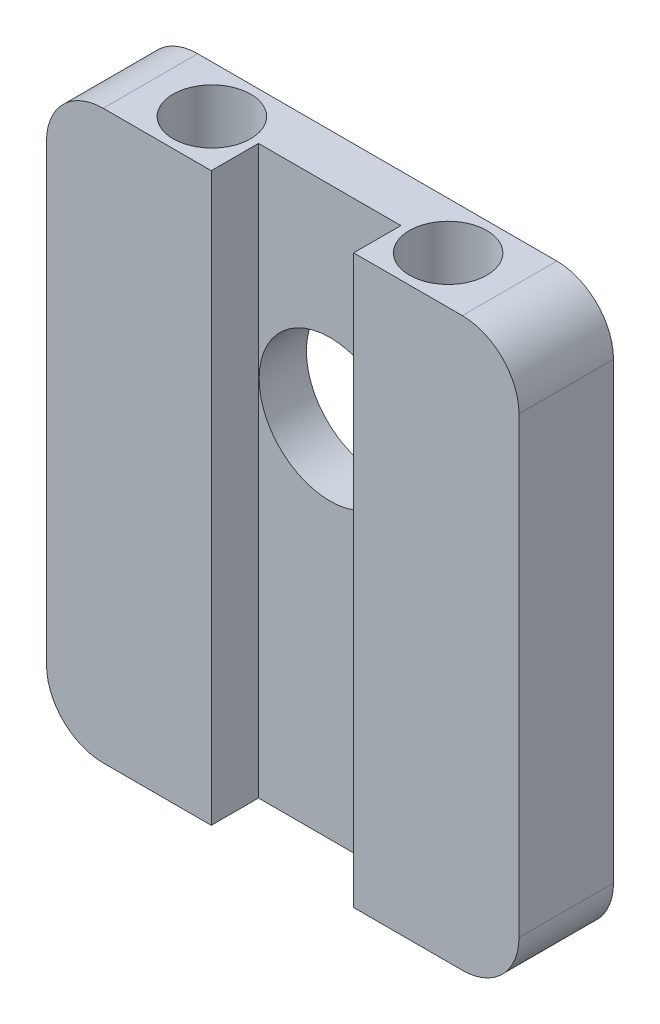
ISO-10303-21;
HEADER;
FILE_DESCRIPTION(('STEP AP214'),'2;1');
FILE_NAME('part.step','',(''),(''),'','','');
FILE_SCHEMA(('AUTOMOTIVE_DESIGN { 1 0 10303 214 1 1 1 1 }'));
ENDSEC;
DATA;
#1=APPLICATION_CONTEXT('core data for automotive mechanical design processes');
#2=APPLICATION_PROTOCOL_DEFINITION('international standard','automotive_design',2000,#1);
#3=PRODUCT_CONTEXT('',#1,'mechanical');
#4=PRODUCT('Part','Part','',(#3));
#5=PRODUCT_RELATED_PRODUCT_CATEGORY('part','',(#4));
#6=PRODUCT_DEFINITION_FORMATION('','',#4);
#7=PRODUCT_DEFINITION_CONTEXT('part definition',#1,'design');
#8=PRODUCT_DEFINITION('design','',#6,#7);
#9=PRODUCT_DEFINITION_SHAPE('','',#8);
#10=(LENGTH_UNIT() NAMED_UNIT(*) SI_UNIT(.MILLI.,.METRE.));
#11=(NAMED_UNIT(*) PLANE_ANGLE_UNIT() SI_UNIT($,.RADIAN.));
#12=(NAMED_UNIT(*) SI_UNIT($,.STERADIAN.) SOLID_ANGLE_UNIT());
#13=UNCERTAINTY_MEASURE_WITH_UNIT(LENGTH_MEASURE(1.E-05),#10,'distance_accuracy_value','');
#14=(GEOMETRIC_REPRESENTATION_CONTEXT(3) GLOBAL_UNCERTAINTY_ASSIGNED_CONTEXT((#13)) GLOBAL_UNIT_ASSIGNED_CONTEXT((#10,
#11,#12)) REPRESENTATION_CONTEXT('',''));
#15=CARTESIAN_POINT('',(0.,0.,0.));
#16=DIRECTION('',(0.,0.,1.));
#17=DIRECTION('',(1.,0.,0.));
#18=AXIS2_PLACEMENT_3D('',#15,#16,#17);
#19=CARTESIAN_POINT('',(0.,76.2,0.));
#20=DIRECTION('',(0.,0.,-1.));
#21=DIRECTION('',(-1.,0.,0.));
#22=AXIS2_PLACEMENT_3D('',#19,#20,#21);
#23=PLANE('',#22);
#24=DIRECTION('',(1.,0.,0.));
#25=VECTOR('',#24,1.);
#26=CARTESIAN_POINT('',(0.,0.,0.));
#27=LINE('',#26,#25);
#28=CARTESIAN_POINT('',(41.275,0.,0.));
#29=VERTEX_POINT('',#28);
#30=CARTESIAN_POINT('',(55.88,0.,0.));
#31=VERTEX_POINT('',#30);
#32=EDGE_CURVE('E177',#29,#31,#27,.T.);
#33=ORIENTED_EDGE('',*,*,#32,.T.);
#34=CARTESIAN_POINT('',(55.88,7.62,0.));
#35=DIRECTION('',(0.,0.,-1.));
#36=DIRECTION('',(-1.,0.,0.));
#37=AXIS2_PLACEMENT_3D('',#34,#35,#36);
#38=CIRCLE('',#37,7.62);
#39=CARTESIAN_POINT('',(63.5,7.62000000000003,0.));
#40=VERTEX_POINT('',#39);
#41=EDGE_CURVE('E57',#31,#40,#38,.F.);
#42=ORIENTED_EDGE('',*,*,#41,.T.);
#43=DIRECTION('',(0.,-1.,0.));
#44=VECTOR('',#43,1.);
#45=CARTESIAN_POINT('',(63.5,76.2,0.));
#46=LINE('',#45,#44);
#47=CARTESIAN_POINT('',(63.5,68.58,0.));
#48=VERTEX_POINT('',#47);
#49=EDGE_CURVE('E203',#48,#40,#46,.T.);
#50=ORIENTED_EDGE('',*,*,#49,.F.);
#51=CARTESIAN_POINT('',(55.88,68.58,0.));
#52=DIRECTION('',(0.,0.,-1.));
#53=DIRECTION('',(-1.,0.,0.));
#54=AXIS2_PLACEMENT_3D('',#51,#52,#53);
#55=CIRCLE('',#54,7.62);
#56=CARTESIAN_POINT('',(55.88,76.2,0.));
#57=VERTEX_POINT('',#56);
#58=EDGE_CURVE('E51',#48,#57,#55,.F.);
#59=ORIENTED_EDGE('',*,*,#58,.T.);
#60=DIRECTION('',(1.,0.,0.));
#61=VECTOR('',#60,1.);
#62=CARTESIAN_POINT('',(0.,76.2,0.));
#63=LINE('',#62,#61);
#64=CARTESIAN_POINT('',(41.275,76.2,0.));
#65=VERTEX_POINT('',#64);
#66=EDGE_CURVE('E189',#65,#57,#63,.T.);
#67=ORIENTED_EDGE('',*,*,#66,.F.);
#68=DIRECTION('',(0.,1.,0.));
#69=VECTOR('',#68,1.);
#70=CARTESIAN_POINT('',(41.275,0.,0.));
#71=LINE('',#70,#69);
#72=EDGE_CURVE('E171',#29,#65,#71,.T.);
#73=ORIENTED_EDGE('',*,*,#72,.F.);
#74=EDGE_LOOP('',(#33,#42,#50,#59,#67,#73));
#75=FACE_BOUND('',#74,.T.);
#76=ADVANCED_FACE('F36',(#75),#23,.F.);
#77=CARTESIAN_POINT('',(0.,76.2,0.));
#78=DIRECTION('',(1.,0.,0.));
#79=DIRECTION('',(0.,0.,-1.));
#80=AXIS2_PLACEMENT_3D('',#77,#78,#79);
#81=PLANE('',#80);
#82=DIRECTION('',(0.,-1.,0.));
#83=VECTOR('',#82,1.);
#84=CARTESIAN_POINT('',(0.,76.2,-12.7));
#85=LINE('',#84,#83);
#86=CARTESIAN_POINT('',(0.,68.58,-12.7));
#87=VERTEX_POINT('',#86);
#88=CARTESIAN_POINT('',(0.,7.62000000000003,-12.7));
#89=VERTEX_POINT('',#88);
#90=EDGE_CURVE('E192',#87,#89,#85,.T.);
#91=ORIENTED_EDGE('',*,*,#90,.T.);
#92=DIRECTION('',(0.,0.,1.));
#93=VECTOR('',#92,1.);
#94=CARTESIAN_POINT('',(0.,7.62,0.));
#95=LINE('',#94,#93);
#96=CARTESIAN_POINT('',(0.,7.62000000000003,0.));
#97=VERTEX_POINT('',#96);
#98=EDGE_CURVE('E210',#89,#97,#95,.T.);
#99=ORIENTED_EDGE('',*,*,#98,.T.);
#100=DIRECTION('',(0.,-1.,0.));
#101=VECTOR('',#100,1.);
#102=CARTESIAN_POINT('',(0.,76.2,0.));
#103=LINE('',#102,#101);
#104=CARTESIAN_POINT('',(0.,68.58,0.));
#105=VERTEX_POINT('',#104);
#106=EDGE_CURVE('E205',#105,#97,#103,.T.);
#107=ORIENTED_EDGE('',*,*,#106,.F.);
#108=DIRECTION('',(0.,0.,1.));
#109=VECTOR('',#108,1.);
#110=CARTESIAN_POINT('',(0.,68.58,0.));
#111=LINE('',#110,#109);
#112=EDGE_CURVE('E208',#105,#87,#111,.F.);
#113=ORIENTED_EDGE('',*,*,#112,.T.);
#114=EDGE_LOOP('',(#91,#99,#107,#113));
#115=FACE_BOUND('',#114,.T.);
#116=ADVANCED_FACE('F262',(#115),#81,.F.);
#117=ORIENTED_EDGE('',*,*,#106,.T.);
#118=CARTESIAN_POINT('',(7.62,7.62,0.));
#119=DIRECTION('',(0.,0.,-1.));
#120=DIRECTION('',(-1.,0.,0.));
#121=AXIS2_PLACEMENT_3D('',#118,#119,#120);
#122=CIRCLE('',#121,7.62);
#123=CARTESIAN_POINT('',(7.62,0.,0.));
#124=VERTEX_POINT('',#123);
#125=EDGE_CURVE('E215',#97,#124,#122,.F.);
#126=ORIENTED_EDGE('',*,*,#125,.T.);
#127=CARTESIAN_POINT('',(22.1411617013507,0.,0.));
#128=VERTEX_POINT('',#127);
#129=EDGE_CURVE('E193',#124,#128,#27,.T.);
#130=ORIENTED_EDGE('',*,*,#129,.T.);
#131=DIRECTION('',(0.,1.,0.));
#132=VECTOR('',#131,1.);
#133=CARTESIAN_POINT('',(22.1411617013507,0.,0.));
#134=LINE('',#133,#132);
#135=CARTESIAN_POINT('',(22.1411617013507,76.2,0.));
#136=VERTEX_POINT('',#135);
#137=EDGE_CURVE('E142',#128,#136,#134,.T.);
#138=ORIENTED_EDGE('',*,*,#137,.T.);
#139=CARTESIAN_POINT('',(7.62,76.2,0.));
#140=VERTEX_POINT('',#139);
#141=EDGE_CURVE('E186',#140,#136,#63,.T.);
#142=ORIENTED_EDGE('',*,*,#141,.F.);
#143=CARTESIAN_POINT('',(7.62,68.58,0.));
#144=DIRECTION('',(0.,0.,-1.));
#145=DIRECTION('',(-1.,0.,0.));
#146=AXIS2_PLACEMENT_3D('',#143,#144,#145);
#147=CIRCLE('',#146,7.62);
#148=EDGE_CURVE('E213',#140,#105,#147,.F.);
#149=ORIENTED_EDGE('',*,*,#148,.T.);
#150=EDGE_LOOP('',(#117,#126,#130,#138,#142,#149));
#151=FACE_BOUND('',#150,.T.);
#152=ADVANCED_FACE('F253',(#151),#23,.F.);
#153=CARTESIAN_POINT('',(63.5,76.2,0.));
#154=DIRECTION('',(-1.,0.,0.));
#155=DIRECTION('',(0.,0.,1.));
#156=AXIS2_PLACEMENT_3D('',#153,#154,#155);
#157=PLANE('',#156);
#158=ORIENTED_EDGE('',*,*,#49,.T.);
#159=DIRECTION('',(0.,0.,-1.));
#160=VECTOR('',#159,1.);
#161=CARTESIAN_POINT('',(63.5,7.62,-12.7));
#162=LINE('',#161,#160);
#163=CARTESIAN_POINT('',(63.5,7.62000000000003,-12.7));
#164=VERTEX_POINT('',#163);
#165=EDGE_CURVE('E231',#40,#164,#162,.T.);
#166=ORIENTED_EDGE('',*,*,#165,.T.);
#167=DIRECTION('',(0.,-1.,0.));
#168=VECTOR('',#167,1.);
#169=CARTESIAN_POINT('',(63.5,76.2,-12.7));
#170=LINE('',#169,#168);
#171=CARTESIAN_POINT('',(63.5,68.58,-12.7));
#172=VERTEX_POINT('',#171);
#173=EDGE_CURVE('E200',#172,#164,#170,.T.);
#174=ORIENTED_EDGE('',*,*,#173,.F.);
#175=DIRECTION('',(0.,0.,-1.));
#176=VECTOR('',#175,1.);
#177=CARTESIAN_POINT('',(63.5,68.58,0.));
#178=LINE('',#177,#176);
#179=EDGE_CURVE('E229',#172,#48,#178,.F.);
#180=ORIENTED_EDGE('',*,*,#179,.T.);
#181=EDGE_LOOP('',(#158,#166,#174,#180));
#182=FACE_BOUND('',#181,.T.);
#183=ADVANCED_FACE('F269',(#182),#157,.F.);
#184=CARTESIAN_POINT('',(0.,76.2,-12.7));
#185=DIRECTION('',(0.,0.,1.));
#186=DIRECTION('',(1.,0.,0.));
#187=AXIS2_PLACEMENT_3D('',#184,#185,#186);
#188=PLANE('',#187);
#189=CARTESIAN_POINT('',(31.75,48.895,-12.7));
#190=DIRECTION('',(0.,0.,-1.));
#191=DIRECTION('',(-1.,0.,0.));
#192=AXIS2_PLACEMENT_3D('',#189,#190,#191);
#193=CIRCLE('',#192,9.525);
#194=CARTESIAN_POINT('',(22.225,48.895,-12.7));
#195=VERTEX_POINT('',#194);
#196=EDGE_CURVE('E295',#195,#195,#193,.T.);
#197=ORIENTED_EDGE('',*,*,#196,.F.);
#198=EDGE_LOOP('',(#197));
#199=FACE_BOUND('',#198,.T.);
#200=DIRECTION('',(-1.,0.,0.));
#201=VECTOR('',#200,1.);
#202=CARTESIAN_POINT('',(0.,0.,-12.7));
#203=LINE('',#202,#201);
#204=CARTESIAN_POINT('',(55.88,0.,-12.7));
#205=VERTEX_POINT('',#204);
#206=CARTESIAN_POINT('',(7.62,0.,-12.7));
#207=VERTEX_POINT('',#206);
#208=EDGE_CURVE('E195',#205,#207,#203,.T.);
#209=ORIENTED_EDGE('',*,*,#208,.T.);
#210=CARTESIAN_POINT('',(7.62,7.62,-12.7));
#211=DIRECTION('',(0.,0.,1.));
#212=DIRECTION('',(1.,0.,0.));
#213=AXIS2_PLACEMENT_3D('',#210,#211,#212);
#214=CIRCLE('',#213,7.62);
#215=EDGE_CURVE('E227',#207,#89,#214,.F.);
#216=ORIENTED_EDGE('',*,*,#215,.T.);
#217=ORIENTED_EDGE('',*,*,#90,.F.);
#218=CARTESIAN_POINT('',(7.62,68.58,-12.7));
#219=DIRECTION('',(0.,0.,1.));
#220=DIRECTION('',(1.,0.,0.));
#221=AXIS2_PLACEMENT_3D('',#218,#219,#220);
#222=CIRCLE('',#221,7.62);
#223=CARTESIAN_POINT('',(7.62,76.2,-12.7));
#224=VERTEX_POINT('',#223);
#225=EDGE_CURVE('E223',#87,#224,#222,.F.);
#226=ORIENTED_EDGE('',*,*,#225,.T.);
#227=DIRECTION('',(-1.,0.,0.));
#228=VECTOR('',#227,1.);
#229=CARTESIAN_POINT('',(0.,76.2,-12.7));
#230=LINE('',#229,#228);
#231=CARTESIAN_POINT('',(55.88,76.2,-12.7));
#232=VERTEX_POINT('',#231);
#233=EDGE_CURVE('E188',#232,#224,#230,.T.);
#234=ORIENTED_EDGE('',*,*,#233,.F.);
#235=CARTESIAN_POINT('',(55.88,68.58,-12.7));
#236=DIRECTION('',(0.,0.,1.));
#237=DIRECTION('',(1.,0.,0.));
#238=AXIS2_PLACEMENT_3D('',#235,#236,#237);
#239=CIRCLE('',#238,7.62);
#240=EDGE_CURVE('E221',#232,#172,#239,.F.);
#241=ORIENTED_EDGE('',*,*,#240,.T.);
#242=ORIENTED_EDGE('',*,*,#173,.T.);
#243=CARTESIAN_POINT('',(55.88,7.62,-12.7));
#244=DIRECTION('',(0.,0.,1.));
#245=DIRECTION('',(1.,0.,0.));
#246=AXIS2_PLACEMENT_3D('',#243,#244,#245);
#247=CIRCLE('',#246,7.62);
#248=EDGE_CURVE('E225',#164,#205,#247,.F.);
#249=ORIENTED_EDGE('',*,*,#248,.T.);
#250=EDGE_LOOP('',(#209,#216,#217,#226,#234,#241,#242,#249));
#251=FACE_BOUND('',#250,.T.);
#252=ADVANCED_FACE('F244',(#199,#251),#188,.F.);
#253=CARTESIAN_POINT('',(0.,76.2,0.));
#254=DIRECTION('',(0.,-1.,0.));
#255=DIRECTION('',(0.,0.,-1.));
#256=AXIS2_PLACEMENT_3D('',#253,#254,#255);
#257=PLANE('',#256);
#258=CARTESIAN_POINT('',(15.875,76.2,-6.35));
#259=DIRECTION('',(0.,1.,0.));
#260=DIRECTION('',(0.,0.,1.));
#261=AXIS2_PLACEMENT_3D('',#258,#259,#260);
#262=CIRCLE('',#261,5.207);
#263=CARTESIAN_POINT('',(15.875,76.2,-1.143));
#264=VERTEX_POINT('',#263);
#265=EDGE_CURVE('E178',#264,#264,#262,.T.);
#266=ORIENTED_EDGE('',*,*,#265,.F.);
#267=EDGE_LOOP('',(#266));
#268=FACE_BOUND('',#267,.T.);
#269=CARTESIAN_POINT('',(47.625,76.2,-6.35));
#270=DIRECTION('',(0.,1.,0.));
#271=DIRECTION('',(0.,0.,1.));
#272=AXIS2_PLACEMENT_3D('',#269,#270,#271);
#273=CIRCLE('',#272,5.20700000000001);
#274=CARTESIAN_POINT('',(47.625,76.2,-1.14299999999999));
#275=VERTEX_POINT('',#274);
#276=EDGE_CURVE('E169',#275,#275,#273,.T.);
#277=ORIENTED_EDGE('',*,*,#276,.F.);
#278=EDGE_LOOP('',(#277));
#279=FACE_BOUND('',#278,.T.);
#280=ORIENTED_EDGE('',*,*,#233,.T.);
#281=DIRECTION('',(0.,0.,1.));
#282=VECTOR('',#281,1.);
#283=CARTESIAN_POINT('',(7.62,76.2,0.));
#284=LINE('',#283,#282);
#285=EDGE_CURVE('E11',#224,#140,#284,.T.);
#286=ORIENTED_EDGE('',*,*,#285,.T.);
#287=ORIENTED_EDGE('',*,*,#141,.T.);
#288=DIRECTION('',(0.,0.,1.));
#289=VECTOR('',#288,1.);
#290=CARTESIAN_POINT('',(22.1411617013507,76.2,0.));
#291=LINE('',#290,#289);
#292=CARTESIAN_POINT('',(22.1411617013507,76.2,-6.35));
#293=VERTEX_POINT('',#292);
#294=EDGE_CURVE('E158',#293,#136,#291,.T.);
#295=ORIENTED_EDGE('',*,*,#294,.F.);
#296=DIRECTION('',(-1.,0.,0.));
#297=VECTOR('',#296,1.);
#298=CARTESIAN_POINT('',(22.1411617013507,76.2,-6.35));
#299=LINE('',#298,#297);
#300=CARTESIAN_POINT('',(41.275,76.2,-6.35));
#301=VERTEX_POINT('',#300);
#302=EDGE_CURVE('E138',#301,#293,#299,.T.);
#303=ORIENTED_EDGE('',*,*,#302,.F.);
#304=DIRECTION('',(0.,0.,-1.));
#305=VECTOR('',#304,1.);
#306=CARTESIAN_POINT('',(41.275,76.2,0.));
#307=LINE('',#306,#305);
#308=EDGE_CURVE('E155',#65,#301,#307,.T.);
#309=ORIENTED_EDGE('',*,*,#308,.F.);
#310=ORIENTED_EDGE('',*,*,#66,.T.);
#311=DIRECTION('',(0.,0.,-1.));
#312=VECTOR('',#311,1.);
#313=CARTESIAN_POINT('',(55.88,76.2,0.));
#314=LINE('',#313,#312);
#315=EDGE_CURVE('E44',#57,#232,#314,.T.);
#316=ORIENTED_EDGE('',*,*,#315,.T.);
#317=EDGE_LOOP('',(#280,#286,#287,#295,#303,#309,#310,#316));
#318=FACE_BOUND('',#317,.T.);
#319=ADVANCED_FACE('F239',(#268,#279,#318),#257,.F.);
#320=CARTESIAN_POINT('',(0.,0.,0.));
#321=DIRECTION('',(0.,-1.,0.));
#322=DIRECTION('',(0.,0.,-1.));
#323=AXIS2_PLACEMENT_3D('',#320,#321,#322);
#324=PLANE('',#323);
#325=ORIENTED_EDGE('',*,*,#129,.F.);
#326=DIRECTION('',(0.,0.,1.));
#327=VECTOR('',#326,1.);
#328=CARTESIAN_POINT('',(7.62,0.,-12.7));
#329=LINE('',#328,#327);
#330=EDGE_CURVE('E219',#124,#207,#329,.F.);
#331=ORIENTED_EDGE('',*,*,#330,.T.);
#332=ORIENTED_EDGE('',*,*,#208,.F.);
#333=DIRECTION('',(0.,0.,-1.));
#334=VECTOR('',#333,1.);
#335=CARTESIAN_POINT('',(55.88,0.,0.));
#336=LINE('',#335,#334);
#337=EDGE_CURVE('E217',#205,#31,#336,.F.);
#338=ORIENTED_EDGE('',*,*,#337,.T.);
#339=ORIENTED_EDGE('',*,*,#32,.F.);
#340=DIRECTION('',(0.,0.,-1.));
#341=VECTOR('',#340,1.);
#342=CARTESIAN_POINT('',(41.275,0.,0.));
#343=LINE('',#342,#341);
#344=CARTESIAN_POINT('',(41.275,0.,-6.35));
#345=VERTEX_POINT('',#344);
#346=EDGE_CURVE('E143',#29,#345,#343,.T.);
#347=ORIENTED_EDGE('',*,*,#346,.T.);
#348=DIRECTION('',(-1.,0.,0.));
#349=VECTOR('',#348,1.);
#350=CARTESIAN_POINT('',(22.1411617013507,0.,-6.35));
#351=LINE('',#350,#349);
#352=CARTESIAN_POINT('',(22.1411617013507,0.,-6.35));
#353=VERTEX_POINT('',#352);
#354=EDGE_CURVE('E135',#345,#353,#351,.T.);
#355=ORIENTED_EDGE('',*,*,#354,.T.);
#356=DIRECTION('',(0.,0.,1.));
#357=VECTOR('',#356,1.);
#358=CARTESIAN_POINT('',(22.1411617013507,0.,0.));
#359=LINE('',#358,#357);
#360=EDGE_CURVE('E147',#353,#128,#359,.T.);
#361=ORIENTED_EDGE('',*,*,#360,.T.);
#362=EDGE_LOOP('',(#325,#331,#332,#338,#339,#347,#355,#361));
#363=FACE_BOUND('',#362,.T.);
#364=ADVANCED_FACE('F153',(#363),#324,.T.);
#365=CARTESIAN_POINT('',(47.625,6.35000000000001,-6.35));
#366=DIRECTION('',(0.,1.,0.));
#367=DIRECTION('',(0.,0.,1.));
#368=AXIS2_PLACEMENT_3D('',#365,#366,#367);
#369=CYLINDRICAL_SURFACE('',#368,5.20700000000001);
#370=CARTESIAN_POINT('',(47.625,6.35000000000001,-6.35));
#371=DIRECTION('',(0.,1.,0.));
#372=DIRECTION('',(0.,0.,1.));
#373=AXIS2_PLACEMENT_3D('',#370,#371,#372);
#374=CIRCLE('',#373,5.20700000000001);
#375=CARTESIAN_POINT('',(47.625,6.35000000000001,-1.14299999999999));
#376=VERTEX_POINT('',#375);
#377=EDGE_CURVE('E181',#376,#376,#374,.T.);
#378=ORIENTED_EDGE('',*,*,#377,.F.);
#379=EDGE_LOOP('',(#378));
#380=FACE_BOUND('',#379,.T.);
#381=ORIENTED_EDGE('',*,*,#276,.T.);
#382=EDGE_LOOP('',(#381));
#383=FACE_BOUND('',#382,.T.);
#384=ADVANCED_FACE('F310',(#380,#383),#369,.F.);
#385=CARTESIAN_POINT('',(47.625,6.35000000000001,-6.35));
#386=DIRECTION('',(0.,1.,0.));
#387=DIRECTION('',(0.,0.,1.));
#388=AXIS2_PLACEMENT_3D('',#385,#386,#387);
#389=PLANE('',#388);
#390=ORIENTED_EDGE('',*,*,#377,.T.);
#391=EDGE_LOOP('',(#390));
#392=FACE_BOUND('',#391,.T.);
#393=ADVANCED_FACE('F314',(#392),#389,.T.);
#394=CARTESIAN_POINT('',(15.875,6.35000000000001,-6.35));
#395=DIRECTION('',(0.,1.,0.));
#396=DIRECTION('',(0.,0.,1.));
#397=AXIS2_PLACEMENT_3D('',#394,#395,#396);
#398=CYLINDRICAL_SURFACE('',#397,5.207);
#399=CARTESIAN_POINT('',(15.875,6.35000000000001,-6.35));
#400=DIRECTION('',(0.,1.,0.));
#401=DIRECTION('',(0.,0.,1.));
#402=AXIS2_PLACEMENT_3D('',#399,#400,#401);
#403=CIRCLE('',#402,5.207);
#404=CARTESIAN_POINT('',(15.875,6.35000000000001,-1.143));
#405=VERTEX_POINT('',#404);
#406=EDGE_CURVE('E174',#405,#405,#403,.T.);
#407=ORIENTED_EDGE('',*,*,#406,.F.);
#408=EDGE_LOOP('',(#407));
#409=FACE_BOUND('',#408,.T.);
#410=ORIENTED_EDGE('',*,*,#265,.T.);
#411=EDGE_LOOP('',(#410));
#412=FACE_BOUND('',#411,.T.);
#413=ADVANCED_FACE('F318',(#409,#412),#398,.F.);
#414=CARTESIAN_POINT('',(15.875,6.35000000000001,-6.35));
#415=DIRECTION('',(0.,1.,0.));
#416=DIRECTION('',(0.,0.,1.));
#417=AXIS2_PLACEMENT_3D('',#414,#415,#416);
#418=PLANE('',#417);
#419=ORIENTED_EDGE('',*,*,#406,.T.);
#420=EDGE_LOOP('',(#419));
#421=FACE_BOUND('',#420,.T.);
#422=ADVANCED_FACE('F322',(#421),#418,.T.);
#423=CARTESIAN_POINT('',(22.1411617013507,0.,-6.35));
#424=DIRECTION('',(0.,0.,-1.));
#425=DIRECTION('',(-1.,0.,0.));
#426=AXIS2_PLACEMENT_3D('',#423,#424,#425);
#427=PLANE('',#426);
#428=DIRECTION('',(0.,1.,0.));
#429=VECTOR('',#428,1.);
#430=CARTESIAN_POINT('',(41.275,0.,-6.35));
#431=LINE('',#430,#429);
#432=CARTESIAN_POINT('',(41.275,48.895,-6.35));
#433=VERTEX_POINT('',#432);
#434=EDGE_CURVE('E167',#345,#433,#431,.T.);
#435=ORIENTED_EDGE('',*,*,#434,.T.);
#436=CARTESIAN_POINT('',(31.75,48.895,-6.35));
#437=DIRECTION('',(0.,0.,-1.));
#438=DIRECTION('',(-1.,0.,0.));
#439=AXIS2_PLACEMENT_3D('',#436,#437,#438);
#440=CIRCLE('',#439,9.525);
#441=EDGE_CURVE('E161',#433,#433,#440,.T.);
#442=ORIENTED_EDGE('',*,*,#441,.T.);
#443=EDGE_CURVE('E170',#433,#301,#431,.T.);
#444=ORIENTED_EDGE('',*,*,#443,.T.);
#445=ORIENTED_EDGE('',*,*,#302,.T.);
#446=DIRECTION('',(0.,1.,0.));
#447=VECTOR('',#446,1.);
#448=CARTESIAN_POINT('',(22.1411617013507,0.,-6.35));
#449=LINE('',#448,#447);
#450=EDGE_CURVE('E130',#353,#293,#449,.T.);
#451=ORIENTED_EDGE('',*,*,#450,.F.);
#452=ORIENTED_EDGE('',*,*,#354,.F.);
#453=EDGE_LOOP('',(#435,#442,#444,#445,#451,#452));
#454=FACE_BOUND('',#453,.T.);
#455=ADVANCED_FACE('F133',(#454),#427,.F.);
#456=CARTESIAN_POINT('',(41.275,0.,0.));
#457=DIRECTION('',(1.,0.,0.));
#458=DIRECTION('',(0.,0.,-1.));
#459=AXIS2_PLACEMENT_3D('',#456,#457,#458);
#460=PLANE('',#459);
#461=ORIENTED_EDGE('',*,*,#72,.T.);
#462=ORIENTED_EDGE('',*,*,#308,.T.);
#463=ORIENTED_EDGE('',*,*,#443,.F.);
#464=ORIENTED_EDGE('',*,*,#434,.F.);
#465=ORIENTED_EDGE('',*,*,#346,.F.);
#466=EDGE_LOOP('',(#461,#462,#463,#464,#465));
#467=FACE_BOUND('',#466,.T.);
#468=ADVANCED_FACE('F291',(#467),#460,.F.);
#469=CARTESIAN_POINT('',(22.1411617013507,0.,0.));
#470=DIRECTION('',(-1.,0.,0.));
#471=DIRECTION('',(0.,0.,1.));
#472=AXIS2_PLACEMENT_3D('',#469,#470,#471);
#473=PLANE('',#472);
#474=ORIENTED_EDGE('',*,*,#294,.T.);
#475=ORIENTED_EDGE('',*,*,#137,.F.);
#476=ORIENTED_EDGE('',*,*,#360,.F.);
#477=ORIENTED_EDGE('',*,*,#450,.T.);
#478=EDGE_LOOP('',(#474,#475,#476,#477));
#479=FACE_BOUND('',#478,.T.);
#480=ADVANCED_FACE('F148',(#479),#473,.F.);
#481=CARTESIAN_POINT('',(31.75,48.895,0.));
#482=DIRECTION('',(0.,0.,-1.));
#483=DIRECTION('',(-1.,0.,0.));
#484=AXIS2_PLACEMENT_3D('',#481,#482,#483);
#485=CYLINDRICAL_SURFACE('',#484,9.525);
#486=ORIENTED_EDGE('',*,*,#196,.T.);
#487=EDGE_LOOP('',(#486));
#488=FACE_BOUND('',#487,.T.);
#489=ORIENTED_EDGE('',*,*,#441,.F.);
#490=EDGE_LOOP('',(#489));
#491=FACE_BOUND('',#490,.T.);
#492=ADVANCED_FACE('F276',(#488,#491),#485,.F.);
#493=CARTESIAN_POINT('',(7.62,7.62,0.));
#494=DIRECTION('',(0.,0.,-1.));
#495=DIRECTION('',(-1.,0.,0.));
#496=AXIS2_PLACEMENT_3D('',#493,#494,#495);
#497=CYLINDRICAL_SURFACE('',#496,7.62);
#498=ORIENTED_EDGE('',*,*,#215,.F.);
#499=ORIENTED_EDGE('',*,*,#330,.F.);
#500=ORIENTED_EDGE('',*,*,#125,.F.);
#501=ORIENTED_EDGE('',*,*,#98,.F.);
#502=EDGE_LOOP('',(#498,#499,#500,#501));
#503=FACE_BOUND('',#502,.T.);
#504=ADVANCED_FACE('F259',(#503),#497,.T.);
#505=CARTESIAN_POINT('',(55.88,7.62,0.));
#506=DIRECTION('',(0.,0.,1.));
#507=DIRECTION('',(1.,0.,0.));
#508=AXIS2_PLACEMENT_3D('',#505,#506,#507);
#509=CYLINDRICAL_SURFACE('',#508,7.62);
#510=ORIENTED_EDGE('',*,*,#41,.F.);
#511=ORIENTED_EDGE('',*,*,#337,.F.);
#512=ORIENTED_EDGE('',*,*,#248,.F.);
#513=ORIENTED_EDGE('',*,*,#165,.F.);
#514=EDGE_LOOP('',(#510,#511,#512,#513));
#515=FACE_BOUND('',#514,.T.);
#516=ADVANCED_FACE('F275',(#515),#509,.T.);
#517=CARTESIAN_POINT('',(7.62,68.58,0.));
#518=DIRECTION('',(0.,0.,1.));
#519=DIRECTION('',(1.,0.,0.));
#520=AXIS2_PLACEMENT_3D('',#517,#518,#519);
#521=CYLINDRICAL_SURFACE('',#520,7.62);
#522=ORIENTED_EDGE('',*,*,#225,.F.);
#523=ORIENTED_EDGE('',*,*,#112,.F.);
#524=ORIENTED_EDGE('',*,*,#148,.F.);
#525=ORIENTED_EDGE('',*,*,#285,.F.);
#526=EDGE_LOOP('',(#522,#523,#524,#525));
#527=FACE_BOUND('',#526,.T.);
#528=ADVANCED_FACE('F250',(#527),#521,.T.);
#529=CARTESIAN_POINT('',(55.88,68.58,0.));
#530=DIRECTION('',(0.,0.,-1.));
#531=DIRECTION('',(-1.,0.,0.));
#532=AXIS2_PLACEMENT_3D('',#529,#530,#531);
#533=CYLINDRICAL_SURFACE('',#532,7.62);
#534=ORIENTED_EDGE('',*,*,#58,.F.);
#535=ORIENTED_EDGE('',*,*,#179,.F.);
#536=ORIENTED_EDGE('',*,*,#240,.F.);
#537=ORIENTED_EDGE('',*,*,#315,.F.);
#538=EDGE_LOOP('',(#534,#535,#536,#537));
#539=FACE_BOUND('',#538,.T.);
#540=ADVANCED_FACE('F38',(#539),#533,.T.);
#541=CLOSED_SHELL('',(#76,#116,#152,#183,#252,#319,#364,#384,#393,#413,#422,#455,#468,#480,#492,
#504,#516,#528,#540));
#542=MANIFOLD_SOLID_BREP('B2',#541);
#543=ADVANCED_BREP_SHAPE_REPRESENTATION('',(#18,#542),#14);
#544=SHAPE_DEFINITION_REPRESENTATION(#9,#543);
ENDSEC;
END-ISO-10303-21;
